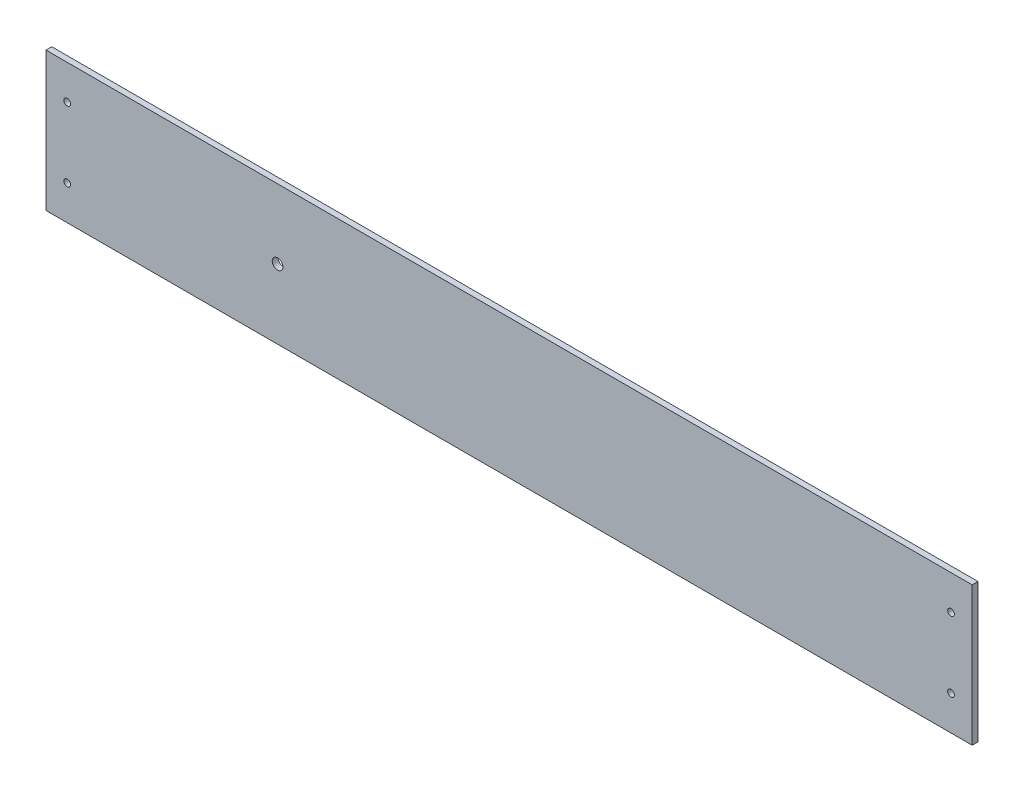
ISO-10303-21;
HEADER;
FILE_DESCRIPTION(('STEP AP214'),'2;1');
FILE_NAME('part.step','',(''),(''),'','','');
FILE_SCHEMA(('AUTOMOTIVE_DESIGN { 1 0 10303 214 1 1 1 1 }'));
ENDSEC;
DATA;
#1=APPLICATION_CONTEXT('core data for automotive mechanical design processes');
#2=APPLICATION_PROTOCOL_DEFINITION('international standard','automotive_design',2000,#1);
#3=PRODUCT_CONTEXT('',#1,'mechanical');
#4=PRODUCT('Part','Part','',(#3));
#5=PRODUCT_RELATED_PRODUCT_CATEGORY('part','',(#4));
#6=PRODUCT_DEFINITION_FORMATION('','',#4);
#7=PRODUCT_DEFINITION_CONTEXT('part definition',#1,'design');
#8=PRODUCT_DEFINITION('design','',#6,#7);
#9=PRODUCT_DEFINITION_SHAPE('','',#8);
#10=(LENGTH_UNIT() NAMED_UNIT(*) SI_UNIT(.MILLI.,.METRE.));
#11=(NAMED_UNIT(*) PLANE_ANGLE_UNIT() SI_UNIT($,.RADIAN.));
#12=(NAMED_UNIT(*) SI_UNIT($,.STERADIAN.) SOLID_ANGLE_UNIT());
#13=UNCERTAINTY_MEASURE_WITH_UNIT(LENGTH_MEASURE(1.E-05),#10,'distance_accuracy_value','');
#14=(GEOMETRIC_REPRESENTATION_CONTEXT(3) GLOBAL_UNCERTAINTY_ASSIGNED_CONTEXT((#13)) GLOBAL_UNIT_ASSIGNED_CONTEXT((#10,
#11,#12)) REPRESENTATION_CONTEXT('',''));
#15=CARTESIAN_POINT('',(0.,0.,0.));
#16=DIRECTION('',(0.,0.,1.));
#17=DIRECTION('',(1.,0.,0.));
#18=AXIS2_PLACEMENT_3D('',#15,#16,#17);
#19=CARTESIAN_POINT('',(0.,0.,3.175));
#20=DIRECTION('',(1.,0.,0.));
#21=DIRECTION('',(0.,0.,-1.));
#22=AXIS2_PLACEMENT_3D('',#19,#20,#21);
#23=PLANE('',#22);
#24=DIRECTION('',(0.,-1.,0.));
#25=VECTOR('',#24,1.);
#26=CARTESIAN_POINT('',(0.,0.,0.));
#27=LINE('',#26,#25);
#28=CARTESIAN_POINT('',(0.,76.2,0.));
#29=VERTEX_POINT('',#28);
#30=CARTESIAN_POINT('',(0.,0.,0.));
#31=VERTEX_POINT('',#30);
#32=EDGE_CURVE('E96',#29,#31,#27,.T.);
#33=ORIENTED_EDGE('',*,*,#32,.T.);
#34=DIRECTION('',(0.,0.,-1.));
#35=VECTOR('',#34,1.);
#36=CARTESIAN_POINT('',(0.,0.,3.175));
#37=LINE('',#36,#35);
#38=CARTESIAN_POINT('',(0.,0.,3.175));
#39=VERTEX_POINT('',#38);
#40=EDGE_CURVE('E11',#39,#31,#37,.T.);
#41=ORIENTED_EDGE('',*,*,#40,.F.);
#42=DIRECTION('',(0.,-1.,0.));
#43=VECTOR('',#42,1.);
#44=CARTESIAN_POINT('',(0.,0.,3.175));
#45=LINE('',#44,#43);
#46=CARTESIAN_POINT('',(0.,76.2,3.175));
#47=VERTEX_POINT('',#46);
#48=EDGE_CURVE('E84',#47,#39,#45,.T.);
#49=ORIENTED_EDGE('',*,*,#48,.F.);
#50=DIRECTION('',(0.,0.,-1.));
#51=VECTOR('',#50,1.);
#52=CARTESIAN_POINT('',(0.,76.2,3.175));
#53=LINE('',#52,#51);
#54=EDGE_CURVE('E92',#47,#29,#53,.T.);
#55=ORIENTED_EDGE('',*,*,#54,.T.);
#56=EDGE_LOOP('',(#33,#41,#49,#55));
#57=FACE_BOUND('',#56,.T.);
#58=ADVANCED_FACE('F33',(#57),#23,.F.);
#59=CARTESIAN_POINT('',(0.,0.,3.175));
#60=DIRECTION('',(0.,1.,0.));
#61=DIRECTION('',(0.,0.,1.));
#62=AXIS2_PLACEMENT_3D('',#59,#60,#61);
#63=PLANE('',#62);
#64=DIRECTION('',(1.,0.,0.));
#65=VECTOR('',#64,1.);
#66=CARTESIAN_POINT('',(0.,0.,0.));
#67=LINE('',#66,#65);
#68=CARTESIAN_POINT('',(508.,0.,0.));
#69=VERTEX_POINT('',#68);
#70=EDGE_CURVE('E88',#31,#69,#67,.T.);
#71=ORIENTED_EDGE('',*,*,#70,.T.);
#72=DIRECTION('',(0.,0.,-1.));
#73=VECTOR('',#72,1.);
#74=CARTESIAN_POINT('',(508.,0.,3.175));
#75=LINE('',#74,#73);
#76=CARTESIAN_POINT('',(508.,0.,3.175));
#77=VERTEX_POINT('',#76);
#78=EDGE_CURVE('E41',#77,#69,#75,.T.);
#79=ORIENTED_EDGE('',*,*,#78,.F.);
#80=DIRECTION('',(1.,0.,0.));
#81=VECTOR('',#80,1.);
#82=CARTESIAN_POINT('',(0.,0.,3.175));
#83=LINE('',#82,#81);
#84=EDGE_CURVE('E79',#39,#77,#83,.T.);
#85=ORIENTED_EDGE('',*,*,#84,.F.);
#86=ORIENTED_EDGE('',*,*,#40,.T.);
#87=EDGE_LOOP('',(#71,#79,#85,#86));
#88=FACE_BOUND('',#87,.T.);
#89=ADVANCED_FACE('F87',(#88),#63,.F.);
#90=CARTESIAN_POINT('',(508.,0.,3.175));
#91=DIRECTION('',(-1.,0.,0.));
#92=DIRECTION('',(0.,0.,1.));
#93=AXIS2_PLACEMENT_3D('',#90,#91,#92);
#94=PLANE('',#93);
#95=DIRECTION('',(0.,1.,0.));
#96=VECTOR('',#95,1.);
#97=CARTESIAN_POINT('',(508.,0.,0.));
#98=LINE('',#97,#96);
#99=CARTESIAN_POINT('',(508.,76.2,0.));
#100=VERTEX_POINT('',#99);
#101=EDGE_CURVE('E66',#69,#100,#98,.T.);
#102=ORIENTED_EDGE('',*,*,#101,.T.);
#103=DIRECTION('',(0.,0.,-1.));
#104=VECTOR('',#103,1.);
#105=CARTESIAN_POINT('',(508.,76.2,3.175));
#106=LINE('',#105,#104);
#107=CARTESIAN_POINT('',(508.,76.2,3.175));
#108=VERTEX_POINT('',#107);
#109=EDGE_CURVE('E89',#108,#100,#106,.T.);
#110=ORIENTED_EDGE('',*,*,#109,.F.);
#111=DIRECTION('',(0.,1.,0.));
#112=VECTOR('',#111,1.);
#113=CARTESIAN_POINT('',(508.,0.,3.175));
#114=LINE('',#113,#112);
#115=EDGE_CURVE('E82',#77,#108,#114,.T.);
#116=ORIENTED_EDGE('',*,*,#115,.F.);
#117=ORIENTED_EDGE('',*,*,#78,.T.);
#118=EDGE_LOOP('',(#102,#110,#116,#117));
#119=FACE_BOUND('',#118,.T.);
#120=ADVANCED_FACE('F90',(#119),#94,.F.);
#121=CARTESIAN_POINT('',(0.,76.2,3.175));
#122=DIRECTION('',(0.,-1.,0.));
#123=DIRECTION('',(0.,0.,-1.));
#124=AXIS2_PLACEMENT_3D('',#121,#122,#123);
#125=PLANE('',#124);
#126=DIRECTION('',(-1.,0.,0.));
#127=VECTOR('',#126,1.);
#128=CARTESIAN_POINT('',(0.,76.2,0.));
#129=LINE('',#128,#127);
#130=EDGE_CURVE('E72',#100,#29,#129,.T.);
#131=ORIENTED_EDGE('',*,*,#130,.T.);
#132=ORIENTED_EDGE('',*,*,#54,.F.);
#133=DIRECTION('',(-1.,0.,0.));
#134=VECTOR('',#133,1.);
#135=CARTESIAN_POINT('',(0.,76.2,3.175));
#136=LINE('',#135,#134);
#137=EDGE_CURVE('E49',#108,#47,#136,.T.);
#138=ORIENTED_EDGE('',*,*,#137,.F.);
#139=ORIENTED_EDGE('',*,*,#109,.T.);
#140=EDGE_LOOP('',(#131,#132,#138,#139));
#141=FACE_BOUND('',#140,.T.);
#142=ADVANCED_FACE('F104',(#141),#125,.F.);
#143=CARTESIAN_POINT('',(0.,76.2,3.175));
#144=DIRECTION('',(0.,0.,-1.));
#145=DIRECTION('',(-1.,0.,0.));
#146=AXIS2_PLACEMENT_3D('',#143,#144,#145);
#147=PLANE('',#146);
#148=CARTESIAN_POINT('',(496.3922,57.3024,3.175));
#149=DIRECTION('',(0.,0.,1.));
#150=DIRECTION('',(-1.,0.,0.));
#151=AXIS2_PLACEMENT_3D('',#148,#149,#150);
#152=CIRCLE('',#151,1.84149999999996);
#153=CARTESIAN_POINT('',(494.5507,57.3024,3.175));
#154=VERTEX_POINT('',#153);
#155=EDGE_CURVE('E134',#154,#154,#152,.T.);
#156=ORIENTED_EDGE('',*,*,#155,.F.);
#157=EDGE_LOOP('',(#156));
#158=FACE_BOUND('',#157,.T.);
#159=CARTESIAN_POINT('',(496.3922,18.8976000000001,3.175));
#160=DIRECTION('',(0.,0.,1.));
#161=DIRECTION('',(1.,0.,0.));
#162=AXIS2_PLACEMENT_3D('',#159,#160,#161);
#163=CIRCLE('',#162,1.84149999999996);
#164=CARTESIAN_POINT('',(498.2337,18.8976000000001,3.175));
#165=VERTEX_POINT('',#164);
#166=EDGE_CURVE('E128',#165,#165,#163,.T.);
#167=ORIENTED_EDGE('',*,*,#166,.F.);
#168=EDGE_LOOP('',(#167));
#169=FACE_BOUND('',#168,.T.);
#170=CARTESIAN_POINT('',(11.6078,18.8976,3.175));
#171=DIRECTION('',(0.,0.,1.));
#172=DIRECTION('',(-1.,0.,0.));
#173=AXIS2_PLACEMENT_3D('',#170,#171,#172);
#174=CIRCLE('',#173,1.8415);
#175=CARTESIAN_POINT('',(9.76629999999999,18.8976,3.175));
#176=VERTEX_POINT('',#175);
#177=EDGE_CURVE('E122',#176,#176,#174,.T.);
#178=ORIENTED_EDGE('',*,*,#177,.F.);
#179=EDGE_LOOP('',(#178));
#180=FACE_BOUND('',#179,.T.);
#181=CARTESIAN_POINT('',(11.6078,57.3024,3.175));
#182=DIRECTION('',(0.,0.,1.));
#183=DIRECTION('',(1.,0.,0.));
#184=AXIS2_PLACEMENT_3D('',#181,#182,#183);
#185=CIRCLE('',#184,1.8415);
#186=CARTESIAN_POINT('',(13.4493,57.3024,3.175));
#187=VERTEX_POINT('',#186);
#188=EDGE_CURVE('E116',#187,#187,#185,.T.);
#189=ORIENTED_EDGE('',*,*,#188,.F.);
#190=EDGE_LOOP('',(#189));
#191=FACE_BOUND('',#190,.T.);
#192=CARTESIAN_POINT('',(127.,38.1,3.175));
#193=DIRECTION('',(0.,0.,1.));
#194=DIRECTION('',(1.,0.,0.));
#195=AXIS2_PLACEMENT_3D('',#192,#193,#194);
#196=CIRCLE('',#195,2.921);
#197=CARTESIAN_POINT('',(129.921,38.1,3.175));
#198=VERTEX_POINT('',#197);
#199=EDGE_CURVE('E110',#198,#198,#196,.T.);
#200=ORIENTED_EDGE('',*,*,#199,.F.);
#201=EDGE_LOOP('',(#200));
#202=FACE_BOUND('',#201,.T.);
#203=ORIENTED_EDGE('',*,*,#48,.T.);
#204=ORIENTED_EDGE('',*,*,#84,.T.);
#205=ORIENTED_EDGE('',*,*,#115,.T.);
#206=ORIENTED_EDGE('',*,*,#137,.T.);
#207=EDGE_LOOP('',(#203,#204,#205,#206));
#208=FACE_BOUND('',#207,.T.);
#209=ADVANCED_FACE('F80',(#158,#169,#180,#191,#202,#208),#147,.F.);
#210=CARTESIAN_POINT('',(0.,76.2,0.));
#211=DIRECTION('',(0.,0.,-1.));
#212=DIRECTION('',(-1.,0.,0.));
#213=AXIS2_PLACEMENT_3D('',#210,#211,#212);
#214=PLANE('',#213);
#215=CARTESIAN_POINT('',(496.3922,57.3024,0.));
#216=DIRECTION('',(0.,0.,1.));
#217=DIRECTION('',(-1.,0.,0.));
#218=AXIS2_PLACEMENT_3D('',#215,#216,#217);
#219=CIRCLE('',#218,1.84149999999996);
#220=CARTESIAN_POINT('',(494.5507,57.3024,0.));
#221=VERTEX_POINT('',#220);
#222=EDGE_CURVE('E131',#221,#221,#219,.T.);
#223=ORIENTED_EDGE('',*,*,#222,.T.);
#224=EDGE_LOOP('',(#223));
#225=FACE_BOUND('',#224,.T.);
#226=CARTESIAN_POINT('',(496.3922,18.8976000000001,0.));
#227=DIRECTION('',(0.,0.,1.));
#228=DIRECTION('',(1.,0.,0.));
#229=AXIS2_PLACEMENT_3D('',#226,#227,#228);
#230=CIRCLE('',#229,1.84149999999996);
#231=CARTESIAN_POINT('',(498.2337,18.8976000000001,0.));
#232=VERTEX_POINT('',#231);
#233=EDGE_CURVE('E125',#232,#232,#230,.T.);
#234=ORIENTED_EDGE('',*,*,#233,.T.);
#235=EDGE_LOOP('',(#234));
#236=FACE_BOUND('',#235,.T.);
#237=CARTESIAN_POINT('',(11.6078,18.8976,0.));
#238=DIRECTION('',(0.,0.,1.));
#239=DIRECTION('',(-1.,0.,0.));
#240=AXIS2_PLACEMENT_3D('',#237,#238,#239);
#241=CIRCLE('',#240,1.8415);
#242=CARTESIAN_POINT('',(9.76629999999999,18.8976,0.));
#243=VERTEX_POINT('',#242);
#244=EDGE_CURVE('E119',#243,#243,#241,.T.);
#245=ORIENTED_EDGE('',*,*,#244,.T.);
#246=EDGE_LOOP('',(#245));
#247=FACE_BOUND('',#246,.T.);
#248=CARTESIAN_POINT('',(11.6078,57.3024,0.));
#249=DIRECTION('',(0.,0.,1.));
#250=DIRECTION('',(1.,0.,0.));
#251=AXIS2_PLACEMENT_3D('',#248,#249,#250);
#252=CIRCLE('',#251,1.8415);
#253=CARTESIAN_POINT('',(13.4493,57.3024,0.));
#254=VERTEX_POINT('',#253);
#255=EDGE_CURVE('E113',#254,#254,#252,.T.);
#256=ORIENTED_EDGE('',*,*,#255,.T.);
#257=EDGE_LOOP('',(#256));
#258=FACE_BOUND('',#257,.T.);
#259=CARTESIAN_POINT('',(127.,38.1,0.));
#260=DIRECTION('',(0.,0.,1.));
#261=DIRECTION('',(1.,0.,0.));
#262=AXIS2_PLACEMENT_3D('',#259,#260,#261);
#263=CIRCLE('',#262,2.921);
#264=CARTESIAN_POINT('',(129.921,38.1,0.));
#265=VERTEX_POINT('',#264);
#266=EDGE_CURVE('E99',#265,#265,#263,.T.);
#267=ORIENTED_EDGE('',*,*,#266,.T.);
#268=EDGE_LOOP('',(#267));
#269=FACE_BOUND('',#268,.T.);
#270=ORIENTED_EDGE('',*,*,#32,.F.);
#271=ORIENTED_EDGE('',*,*,#130,.F.);
#272=ORIENTED_EDGE('',*,*,#101,.F.);
#273=ORIENTED_EDGE('',*,*,#70,.F.);
#274=EDGE_LOOP('',(#270,#271,#272,#273));
#275=FACE_BOUND('',#274,.T.);
#276=ADVANCED_FACE('F107',(#225,#236,#247,#258,#269,#275),#214,.T.);
#277=CARTESIAN_POINT('',(127.,38.1,0.));
#278=DIRECTION('',(0.,0.,1.));
#279=DIRECTION('',(1.,0.,0.));
#280=AXIS2_PLACEMENT_3D('',#277,#278,#279);
#281=CYLINDRICAL_SURFACE('',#280,2.921);
#282=ORIENTED_EDGE('',*,*,#266,.F.);
#283=EDGE_LOOP('',(#282));
#284=FACE_BOUND('',#283,.T.);
#285=ORIENTED_EDGE('',*,*,#199,.T.);
#286=EDGE_LOOP('',(#285));
#287=FACE_BOUND('',#286,.T.);
#288=ADVANCED_FACE('F160',(#284,#287),#281,.F.);
#289=CARTESIAN_POINT('',(11.6078,57.3024,0.));
#290=DIRECTION('',(0.,0.,1.));
#291=DIRECTION('',(1.,0.,0.));
#292=AXIS2_PLACEMENT_3D('',#289,#290,#291);
#293=CYLINDRICAL_SURFACE('',#292,1.8415);
#294=ORIENTED_EDGE('',*,*,#255,.F.);
#295=EDGE_LOOP('',(#294));
#296=FACE_BOUND('',#295,.T.);
#297=ORIENTED_EDGE('',*,*,#188,.T.);
#298=EDGE_LOOP('',(#297));
#299=FACE_BOUND('',#298,.T.);
#300=ADVANCED_FACE('F162',(#296,#299),#293,.F.);
#301=CARTESIAN_POINT('',(11.6078,18.8976,0.));
#302=DIRECTION('',(0.,0.,1.));
#303=DIRECTION('',(1.,0.,0.));
#304=AXIS2_PLACEMENT_3D('',#301,#302,#303);
#305=CYLINDRICAL_SURFACE('',#304,1.8415);
#306=ORIENTED_EDGE('',*,*,#244,.F.);
#307=EDGE_LOOP('',(#306));
#308=FACE_BOUND('',#307,.T.);
#309=ORIENTED_EDGE('',*,*,#177,.T.);
#310=EDGE_LOOP('',(#309));
#311=FACE_BOUND('',#310,.T.);
#312=ADVANCED_FACE('F169',(#308,#311),#305,.F.);
#313=CARTESIAN_POINT('',(496.3922,18.8976000000001,0.));
#314=DIRECTION('',(0.,0.,1.));
#315=DIRECTION('',(1.,0.,0.));
#316=AXIS2_PLACEMENT_3D('',#313,#314,#315);
#317=CYLINDRICAL_SURFACE('',#316,1.84149999999996);
#318=ORIENTED_EDGE('',*,*,#233,.F.);
#319=EDGE_LOOP('',(#318));
#320=FACE_BOUND('',#319,.T.);
#321=ORIENTED_EDGE('',*,*,#166,.T.);
#322=EDGE_LOOP('',(#321));
#323=FACE_BOUND('',#322,.T.);
#324=ADVANCED_FACE('F145',(#320,#323),#317,.F.);
#325=CARTESIAN_POINT('',(496.3922,57.3024,0.));
#326=DIRECTION('',(0.,0.,1.));
#327=DIRECTION('',(1.,0.,0.));
#328=AXIS2_PLACEMENT_3D('',#325,#326,#327);
#329=CYLINDRICAL_SURFACE('',#328,1.84149999999996);
#330=ORIENTED_EDGE('',*,*,#222,.F.);
#331=EDGE_LOOP('',(#330));
#332=FACE_BOUND('',#331,.T.);
#333=ORIENTED_EDGE('',*,*,#155,.T.);
#334=EDGE_LOOP('',(#333));
#335=FACE_BOUND('',#334,.T.);
#336=ADVANCED_FACE('F142',(#332,#335),#329,.F.);
#337=CLOSED_SHELL('',(#58,#89,#120,#142,#209,#276,#288,#300,#312,#324,#336));
#338=MANIFOLD_SOLID_BREP('B2',#337);
#339=ADVANCED_BREP_SHAPE_REPRESENTATION('',(#18,#338),#14);
#340=SHAPE_DEFINITION_REPRESENTATION(#9,#339);
ENDSEC;
END-ISO-10303-21;
